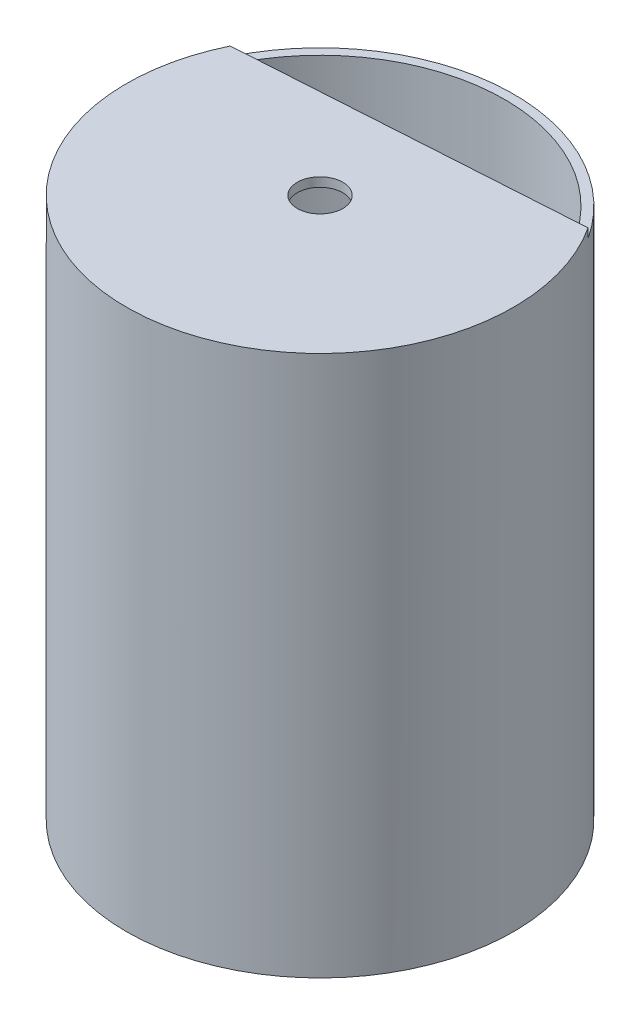
ISO-10303-21;
HEADER;
FILE_DESCRIPTION(('STEP AP214'),'2;1');
FILE_NAME('part.step','',(''),(''),'','','');
FILE_SCHEMA(('AUTOMOTIVE_DESIGN { 1 0 10303 214 1 1 1 1 }'));
ENDSEC;
DATA;
#1=APPLICATION_CONTEXT('core data for automotive mechanical design processes');
#2=APPLICATION_PROTOCOL_DEFINITION('international standard','automotive_design',2000,#1);
#3=PRODUCT_CONTEXT('',#1,'mechanical');
#4=PRODUCT('Part','Part','',(#3));
#5=PRODUCT_RELATED_PRODUCT_CATEGORY('part','',(#4));
#6=PRODUCT_DEFINITION_FORMATION('','',#4);
#7=PRODUCT_DEFINITION_CONTEXT('part definition',#1,'design');
#8=PRODUCT_DEFINITION('design','',#6,#7);
#9=PRODUCT_DEFINITION_SHAPE('','',#8);
#10=(LENGTH_UNIT() NAMED_UNIT(*) SI_UNIT(.MILLI.,.METRE.));
#11=(NAMED_UNIT(*) PLANE_ANGLE_UNIT() SI_UNIT($,.RADIAN.));
#12=(NAMED_UNIT(*) SI_UNIT($,.STERADIAN.) SOLID_ANGLE_UNIT());
#13=UNCERTAINTY_MEASURE_WITH_UNIT(LENGTH_MEASURE(1.E-05),#10,'distance_accuracy_value','');
#14=(GEOMETRIC_REPRESENTATION_CONTEXT(3) GLOBAL_UNCERTAINTY_ASSIGNED_CONTEXT((#13)) GLOBAL_UNIT_ASSIGNED_CONTEXT((#10,
#11,#12)) REPRESENTATION_CONTEXT('',''));
#15=CARTESIAN_POINT('',(0.,0.,0.));
#16=DIRECTION('',(0.,0.,1.));
#17=DIRECTION('',(1.,0.,0.));
#18=AXIS2_PLACEMENT_3D('',#15,#16,#17);
#19=CARTESIAN_POINT('',(0.,29.6418,0.));
#20=DIRECTION('',(0.,-1.,0.));
#21=DIRECTION('',(0.,0.,-1.));
#22=AXIS2_PLACEMENT_3D('',#19,#20,#21);
#23=CYLINDRICAL_SURFACE('',#22,10.287);
#24=CARTESIAN_POINT('',(0.,29.6418,0.));
#25=DIRECTION('',(0.,1.,0.));
#26=DIRECTION('',(0.,0.,1.));
#27=AXIS2_PLACEMENT_3D('',#24,#25,#26);
#28=CIRCLE('',#27,10.287);
#29=CARTESIAN_POINT('',(-9.12683357701817,29.6418,-4.74586955756412));
#30=VERTEX_POINT('',#29);
#31=CARTESIAN_POINT('',(-6.55041500925158,29.6418,7.93186183733502));
#32=VERTEX_POINT('',#31);
#33=EDGE_CURVE('E99',#30,#32,#28,.T.);
#34=ORIENTED_EDGE('',*,*,#33,.T.);
#35=DIRECTION('',(0.,-1.,0.));
#36=VECTOR('',#35,1.);
#37=CARTESIAN_POINT('',(-6.55041500925158,30.1518,7.93186183733502));
#38=LINE('',#37,#36);
#39=CARTESIAN_POINT('',(-6.55041500925158,0.,7.93186183733502));
#40=VERTEX_POINT('',#39);
#41=EDGE_CURVE('E60',#32,#40,#38,.T.);
#42=ORIENTED_EDGE('',*,*,#41,.T.);
#43=CARTESIAN_POINT('',(0.,0.,0.));
#44=DIRECTION('',(0.,1.,0.));
#45=DIRECTION('',(0.,0.,1.));
#46=AXIS2_PLACEMENT_3D('',#43,#44,#45);
#47=CIRCLE('',#46,10.287);
#48=CARTESIAN_POINT('',(7.50270814930954,0.,7.03787890108123));
#49=VERTEX_POINT('',#48);
#50=EDGE_CURVE('E64',#49,#40,#47,.T.);
#51=ORIENTED_EDGE('',*,*,#50,.F.);
#52=DIRECTION('',(0.,-1.,0.));
#53=VECTOR('',#52,1.);
#54=CARTESIAN_POINT('',(7.50270814930954,30.1518,7.03787890108123));
#55=LINE('',#54,#53);
#56=CARTESIAN_POINT('',(7.50270814930954,29.6418,7.03787890108123));
#57=VERTEX_POINT('',#56);
#58=EDGE_CURVE('E102',#57,#49,#55,.T.);
#59=ORIENTED_EDGE('',*,*,#58,.F.);
#60=CARTESIAN_POINT('',(8.45188326183957,29.6418,-5.86413150673109));
#61=VERTEX_POINT('',#60);
#62=EDGE_CURVE('E91',#57,#61,#28,.T.);
#63=ORIENTED_EDGE('',*,*,#62,.T.);
#64=EDGE_CURVE('E101',#61,#30,#28,.T.);
#65=ORIENTED_EDGE('',*,*,#64,.T.);
#66=EDGE_LOOP('',(#34,#42,#51,#59,#63,#65));
#67=FACE_BOUND('',#66,.T.);
#68=ADVANCED_FACE('F41',(#67),#23,.F.);
#69=CARTESIAN_POINT('',(0.,29.6418,0.));
#70=DIRECTION('',(0.,1.,0.));
#71=DIRECTION('',(0.,0.,1.));
#72=AXIS2_PLACEMENT_3D('',#69,#70,#71);
#73=PLANE('',#72);
#74=CARTESIAN_POINT('',(0.,29.6418,0.));
#75=DIRECTION('',(0.,1.,0.));
#76=DIRECTION('',(0.,0.,1.));
#77=AXIS2_PLACEMENT_3D('',#74,#75,#76);
#78=CIRCLE('',#77,1.27);
#79=CARTESIAN_POINT('',(0.,29.6418,1.27));
#80=VERTEX_POINT('',#79);
#81=EDGE_CURVE('E45',#80,#80,#78,.T.);
#82=ORIENTED_EDGE('',*,*,#81,.T.);
#83=EDGE_LOOP('',(#82));
#84=FACE_BOUND('',#83,.T.);
#85=DIRECTION('',(-0.997982715894415,0.,0.0634862093371973));
#86=VECTOR('',#85,1.);
#87=CARTESIAN_POINT('',(0.47614657002898,29.6418,7.48487036920813));
#88=LINE('',#87,#86);
#89=EDGE_CURVE('E94',#57,#32,#88,.T.);
#90=ORIENTED_EDGE('',*,*,#89,.T.);
#91=ORIENTED_EDGE('',*,*,#33,.F.);
#92=DIRECTION('',(0.997982715894416,0.,-0.0634862093371972));
#93=VECTOR('',#92,1.);
#94=CARTESIAN_POINT('',(-0.3374751575893,29.6418,-5.3050005321476));
#95=LINE('',#94,#93);
#96=EDGE_CURVE('E53',#30,#61,#95,.T.);
#97=ORIENTED_EDGE('',*,*,#96,.T.);
#98=ORIENTED_EDGE('',*,*,#62,.F.);
#99=EDGE_LOOP('',(#90,#91,#97,#98));
#100=FACE_BOUND('',#99,.T.);
#101=ADVANCED_FACE('F92',(#84,#100),#73,.F.);
#102=CARTESIAN_POINT('',(0.,29.6418,0.));
#103=DIRECTION('',(0.,1.,0.));
#104=DIRECTION('',(0.,0.,1.));
#105=AXIS2_PLACEMENT_3D('',#102,#103,#104);
#106=PLANE('',#105);
#107=CARTESIAN_POINT('',(0.,29.6418,0.));
#108=DIRECTION('',(0.,1.,0.));
#109=DIRECTION('',(0.,0.,1.));
#110=AXIS2_PLACEMENT_3D('',#107,#108,#109);
#111=CIRCLE('',#110,10.795);
#112=CARTESIAN_POINT('',(9.03905469997451,29.6418,-5.90148414645576));
#113=VERTEX_POINT('',#112);
#114=CARTESIAN_POINT('',(-9.71400501515311,29.6418,-4.70851691783944));
#115=VERTEX_POINT('',#114);
#116=EDGE_CURVE('E50',#113,#115,#111,.T.);
#117=ORIENTED_EDGE('',*,*,#116,.T.);
#118=EDGE_CURVE('E52',#115,#30,#95,.T.);
#119=ORIENTED_EDGE('',*,*,#118,.T.);
#120=ORIENTED_EDGE('',*,*,#64,.F.);
#121=EDGE_CURVE('E12',#61,#113,#95,.T.);
#122=ORIENTED_EDGE('',*,*,#121,.T.);
#123=EDGE_LOOP('',(#117,#119,#120,#122));
#124=FACE_BOUND('',#123,.T.);
#125=ADVANCED_FACE('F135',(#124),#106,.T.);
#126=CARTESIAN_POINT('',(0.,0.,0.));
#127=DIRECTION('',(0.,1.,0.));
#128=DIRECTION('',(0.,0.,1.));
#129=AXIS2_PLACEMENT_3D('',#126,#127,#128);
#130=PLANE('',#129);
#131=CARTESIAN_POINT('',(0.,0.,0.));
#132=DIRECTION('',(0.,1.,0.));
#133=DIRECTION('',(0.,0.,1.));
#134=AXIS2_PLACEMENT_3D('',#131,#132,#133);
#135=CIRCLE('',#134,10.795);
#136=CARTESIAN_POINT('',(0.,0.,10.795));
#137=VERTEX_POINT('',#136);
#138=EDGE_CURVE('E125',#137,#137,#135,.T.);
#139=ORIENTED_EDGE('',*,*,#138,.F.);
#140=EDGE_LOOP('',(#139));
#141=FACE_BOUND('',#140,.T.);
#142=ORIENTED_EDGE('',*,*,#50,.T.);
#143=DIRECTION('',(-0.997982715894416,0.,0.0634862093371973));
#144=VECTOR('',#143,1.);
#145=CARTESIAN_POINT('',(0.47614657002898,0.,7.48487036920813));
#146=LINE('',#145,#144);
#147=EDGE_CURVE('E114',#49,#40,#146,.T.);
#148=ORIENTED_EDGE('',*,*,#147,.F.);
#149=EDGE_LOOP('',(#142,#148));
#150=FACE_BOUND('',#149,.T.);
#151=ADVANCED_FACE('F132',(#141,#150),#130,.F.);
#152=CARTESIAN_POINT('',(0.,29.6418,0.));
#153=DIRECTION('',(0.,-1.,0.));
#154=DIRECTION('',(0.,0.,-1.));
#155=AXIS2_PLACEMENT_3D('',#152,#153,#154);
#156=CYLINDRICAL_SURFACE('',#155,10.795);
#157=ORIENTED_EDGE('',*,*,#116,.F.);
#158=DIRECTION('',(0.,-1.,0.));
#159=VECTOR('',#158,1.);
#160=CARTESIAN_POINT('',(9.03905469997451,30.1498,-5.90148414645576));
#161=LINE('',#160,#159);
#162=CARTESIAN_POINT('',(9.03905469997451,30.1498,-5.90148414645576));
#163=VERTEX_POINT('',#162);
#164=EDGE_CURVE('E119',#163,#113,#161,.T.);
#165=ORIENTED_EDGE('',*,*,#164,.F.);
#166=CARTESIAN_POINT('',(0.,30.1498,0.));
#167=DIRECTION('',(0.,1.,0.));
#168=DIRECTION('',(0.,0.,1.));
#169=AXIS2_PLACEMENT_3D('',#166,#167,#168);
#170=CIRCLE('',#169,10.795);
#171=CARTESIAN_POINT('',(-9.71400501515311,30.1498,-4.70851691783944));
#172=VERTEX_POINT('',#171);
#173=EDGE_CURVE('E118',#172,#163,#170,.T.);
#174=ORIENTED_EDGE('',*,*,#173,.F.);
#175=DIRECTION('',(0.,-1.,0.));
#176=VECTOR('',#175,1.);
#177=CARTESIAN_POINT('',(-9.71400501515311,30.1498,-4.70851691783944));
#178=LINE('',#177,#176);
#179=EDGE_CURVE('E123',#172,#115,#178,.T.);
#180=ORIENTED_EDGE('',*,*,#179,.T.);
#181=EDGE_LOOP('',(#157,#165,#174,#180));
#182=FACE_BOUND('',#181,.T.);
#183=ORIENTED_EDGE('',*,*,#138,.T.);
#184=EDGE_LOOP('',(#183));
#185=FACE_BOUND('',#184,.T.);
#186=ADVANCED_FACE('F43',(#182,#185),#156,.T.);
#187=CARTESIAN_POINT('',(-0.3374751575893,30.1498,-5.3050005321476));
#188=DIRECTION('',(-0.0634862093371972,0.,-0.997982715894415));
#189=DIRECTION('',(-0.997982715894415,0.,0.0634862093371972));
#190=AXIS2_PLACEMENT_3D('',#187,#188,#189);
#191=PLANE('',#190);
#192=ORIENTED_EDGE('',*,*,#118,.F.);
#193=ORIENTED_EDGE('',*,*,#179,.F.);
#194=DIRECTION('',(0.997982715894416,0.,-0.0634862093371972));
#195=VECTOR('',#194,1.);
#196=CARTESIAN_POINT('',(-0.3374751575893,30.1498,-5.3050005321476));
#197=LINE('',#196,#195);
#198=EDGE_CURVE('E115',#172,#163,#197,.T.);
#199=ORIENTED_EDGE('',*,*,#198,.T.);
#200=ORIENTED_EDGE('',*,*,#164,.T.);
#201=ORIENTED_EDGE('',*,*,#121,.F.);
#202=ORIENTED_EDGE('',*,*,#96,.F.);
#203=EDGE_LOOP('',(#192,#193,#199,#200,#201,#202));
#204=FACE_BOUND('',#203,.T.);
#205=ADVANCED_FACE('F142',(#204),#191,.T.);
#206=CARTESIAN_POINT('',(0.,30.1498,0.));
#207=DIRECTION('',(0.,1.,0.));
#208=DIRECTION('',(0.,0.,1.));
#209=AXIS2_PLACEMENT_3D('',#206,#207,#208);
#210=PLANE('',#209);
#211=CARTESIAN_POINT('',(0.,30.1498,0.));
#212=DIRECTION('',(0.,1.,0.));
#213=DIRECTION('',(0.,0.,1.));
#214=AXIS2_PLACEMENT_3D('',#211,#212,#213);
#215=CIRCLE('',#214,1.27);
#216=CARTESIAN_POINT('',(0.,30.1498,1.27));
#217=VERTEX_POINT('',#216);
#218=EDGE_CURVE('E111',#217,#217,#215,.T.);
#219=ORIENTED_EDGE('',*,*,#218,.F.);
#220=EDGE_LOOP('',(#219));
#221=FACE_BOUND('',#220,.T.);
#222=ORIENTED_EDGE('',*,*,#198,.F.);
#223=ORIENTED_EDGE('',*,*,#173,.T.);
#224=EDGE_LOOP('',(#222,#223));
#225=FACE_BOUND('',#224,.T.);
#226=ADVANCED_FACE('F157',(#221,#225),#210,.T.);
#227=CARTESIAN_POINT('',(0.,0.,0.));
#228=DIRECTION('',(0.,1.,0.));
#229=DIRECTION('',(0.,0.,1.));
#230=AXIS2_PLACEMENT_3D('',#227,#228,#229);
#231=CYLINDRICAL_SURFACE('',#230,1.27);
#232=ORIENTED_EDGE('',*,*,#218,.T.);
#233=EDGE_LOOP('',(#232));
#234=FACE_BOUND('',#233,.T.);
#235=ORIENTED_EDGE('',*,*,#81,.F.);
#236=EDGE_LOOP('',(#235));
#237=FACE_BOUND('',#236,.T.);
#238=ADVANCED_FACE('F162',(#234,#237),#231,.F.);
#239=CARTESIAN_POINT('',(0.47614657002898,30.1518,7.48487036920813));
#240=DIRECTION('',(0.0634862093371973,0.,0.997982715894415));
#241=DIRECTION('',(0.997982715894415,0.,-0.0634862093371973));
#242=AXIS2_PLACEMENT_3D('',#239,#240,#241);
#243=PLANE('',#242);
#244=ORIENTED_EDGE('',*,*,#89,.F.);
#245=ORIENTED_EDGE('',*,*,#58,.T.);
#246=ORIENTED_EDGE('',*,*,#147,.T.);
#247=ORIENTED_EDGE('',*,*,#41,.F.);
#248=EDGE_LOOP('',(#244,#245,#246,#247));
#249=FACE_BOUND('',#248,.T.);
#250=ADVANCED_FACE('F107',(#249),#243,.F.);
#251=CLOSED_SHELL('',(#68,#101,#125,#151,#186,#205,#226,#238,#250));
#252=MANIFOLD_SOLID_BREP('B2',#251);
#253=ADVANCED_BREP_SHAPE_REPRESENTATION('',(#18,#252),#14);
#254=SHAPE_DEFINITION_REPRESENTATION(#9,#253);
ENDSEC;
END-ISO-10303-21;
